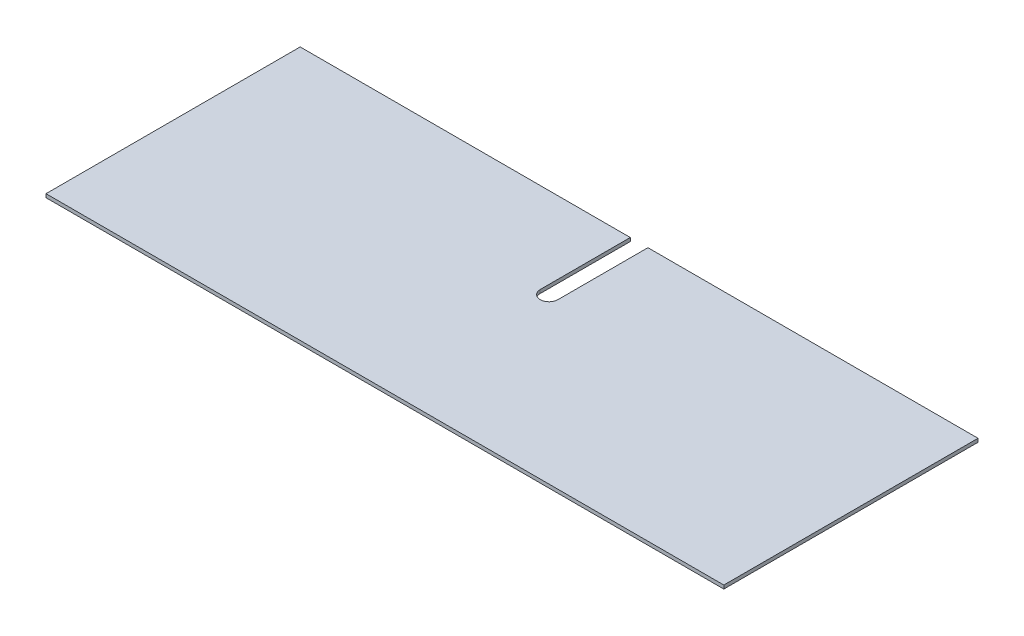
ISO-10303-21;
HEADER;
FILE_DESCRIPTION(('STEP AP214'),'2;1');
FILE_NAME('part.step','',(''),(''),'','','');
FILE_SCHEMA(('AUTOMOTIVE_DESIGN { 1 0 10303 214 1 1 1 1 }'));
ENDSEC;
DATA;
#1=APPLICATION_CONTEXT('core data for automotive mechanical design processes');
#2=APPLICATION_PROTOCOL_DEFINITION('international standard','automotive_design',2000,#1);
#3=PRODUCT_CONTEXT('',#1,'mechanical');
#4=PRODUCT('Part','Part','',(#3));
#5=PRODUCT_RELATED_PRODUCT_CATEGORY('part','',(#4));
#6=PRODUCT_DEFINITION_FORMATION('','',#4);
#7=PRODUCT_DEFINITION_CONTEXT('part definition',#1,'design');
#8=PRODUCT_DEFINITION('design','',#6,#7);
#9=PRODUCT_DEFINITION_SHAPE('','',#8);
#10=(LENGTH_UNIT() NAMED_UNIT(*) SI_UNIT(.MILLI.,.METRE.));
#11=(NAMED_UNIT(*) PLANE_ANGLE_UNIT() SI_UNIT($,.RADIAN.));
#12=(NAMED_UNIT(*) SI_UNIT($,.STERADIAN.) SOLID_ANGLE_UNIT());
#13=UNCERTAINTY_MEASURE_WITH_UNIT(LENGTH_MEASURE(1.E-05),#10,'distance_accuracy_value','');
#14=(GEOMETRIC_REPRESENTATION_CONTEXT(3) GLOBAL_UNCERTAINTY_ASSIGNED_CONTEXT((#13)) GLOBAL_UNIT_ASSIGNED_CONTEXT((#10,
#11,#12)) REPRESENTATION_CONTEXT('',''));
#15=CARTESIAN_POINT('',(0.,0.,0.));
#16=DIRECTION('',(0.,0.,1.));
#17=DIRECTION('',(1.,0.,0.));
#18=AXIS2_PLACEMENT_3D('',#15,#16,#17);
#19=CARTESIAN_POINT('',(0.,3.175,-228.6));
#20=DIRECTION('',(0.,0.,1.));
#21=DIRECTION('',(1.,0.,0.));
#22=AXIS2_PLACEMENT_3D('',#19,#20,#21);
#23=PLANE('',#22);
#24=DIRECTION('',(-1.,0.,0.));
#25=VECTOR('',#24,1.);
#26=CARTESIAN_POINT('',(0.,3.175,-228.6));
#27=LINE('',#26,#25);
#28=CARTESIAN_POINT('',(296.8625,3.175,-228.6));
#29=VERTEX_POINT('',#28);
#30=CARTESIAN_POINT('',(0.,3.175,-228.6));
#31=VERTEX_POINT('',#30);
#32=EDGE_CURVE('E70',#29,#31,#27,.T.);
#33=ORIENTED_EDGE('',*,*,#32,.F.);
#34=DIRECTION('',(0.,1.,0.));
#35=VECTOR('',#34,1.);
#36=CARTESIAN_POINT('',(296.8625,0.,-228.6));
#37=LINE('',#36,#35);
#38=CARTESIAN_POINT('',(296.8625,0.,-228.6));
#39=VERTEX_POINT('',#38);
#40=EDGE_CURVE('E162',#39,#29,#37,.T.);
#41=ORIENTED_EDGE('',*,*,#40,.F.);
#42=DIRECTION('',(-1.,0.,0.));
#43=VECTOR('',#42,1.);
#44=CARTESIAN_POINT('',(0.,0.,-228.6));
#45=LINE('',#44,#43);
#46=CARTESIAN_POINT('',(0.,0.,-228.6));
#47=VERTEX_POINT('',#46);
#48=EDGE_CURVE('E95',#39,#47,#45,.T.);
#49=ORIENTED_EDGE('',*,*,#48,.T.);
#50=DIRECTION('',(0.,-1.,0.));
#51=VECTOR('',#50,1.);
#52=CARTESIAN_POINT('',(0.,3.175,-228.6));
#53=LINE('',#52,#51);
#54=EDGE_CURVE('E185',#31,#47,#53,.T.);
#55=ORIENTED_EDGE('',*,*,#54,.F.);
#56=EDGE_LOOP('',(#33,#41,#49,#55));
#57=FACE_BOUND('',#56,.T.);
#58=ADVANCED_FACE('F40',(#57),#23,.F.);
#59=CARTESIAN_POINT('',(0.,3.175,0.));
#60=DIRECTION('',(1.,0.,0.));
#61=DIRECTION('',(0.,0.,-1.));
#62=AXIS2_PLACEMENT_3D('',#59,#60,#61);
#63=PLANE('',#62);
#64=DIRECTION('',(0.,0.,1.));
#65=VECTOR('',#64,1.);
#66=CARTESIAN_POINT('',(0.,0.,0.));
#67=LINE('',#66,#65);
#68=CARTESIAN_POINT('',(0.,0.,0.));
#69=VERTEX_POINT('',#68);
#70=EDGE_CURVE('E165',#47,#69,#67,.T.);
#71=ORIENTED_EDGE('',*,*,#70,.T.);
#72=DIRECTION('',(0.,-1.,0.));
#73=VECTOR('',#72,1.);
#74=CARTESIAN_POINT('',(0.,3.175,0.));
#75=LINE('',#74,#73);
#76=CARTESIAN_POINT('',(0.,3.175,0.));
#77=VERTEX_POINT('',#76);
#78=EDGE_CURVE('E11',#77,#69,#75,.T.);
#79=ORIENTED_EDGE('',*,*,#78,.F.);
#80=DIRECTION('',(0.,0.,1.));
#81=VECTOR('',#80,1.);
#82=CARTESIAN_POINT('',(0.,3.175,0.));
#83=LINE('',#82,#81);
#84=EDGE_CURVE('E172',#31,#77,#83,.T.);
#85=ORIENTED_EDGE('',*,*,#84,.F.);
#86=ORIENTED_EDGE('',*,*,#54,.T.);
#87=EDGE_LOOP('',(#71,#79,#85,#86));
#88=FACE_BOUND('',#87,.T.);
#89=ADVANCED_FACE('F42',(#88),#63,.F.);
#90=CARTESIAN_POINT('',(0.,3.175,0.));
#91=DIRECTION('',(0.,0.,-1.));
#92=DIRECTION('',(-1.,0.,0.));
#93=AXIS2_PLACEMENT_3D('',#90,#91,#92);
#94=PLANE('',#93);
#95=DIRECTION('',(1.,0.,0.));
#96=VECTOR('',#95,1.);
#97=CARTESIAN_POINT('',(0.,0.,0.));
#98=LINE('',#97,#96);
#99=CARTESIAN_POINT('',(609.6,0.,0.));
#100=VERTEX_POINT('',#99);
#101=EDGE_CURVE('E189',#69,#100,#98,.T.);
#102=ORIENTED_EDGE('',*,*,#101,.T.);
#103=DIRECTION('',(0.,-1.,0.));
#104=VECTOR('',#103,1.);
#105=CARTESIAN_POINT('',(609.6,3.175,0.));
#106=LINE('',#105,#104);
#107=CARTESIAN_POINT('',(609.6,3.175,0.));
#108=VERTEX_POINT('',#107);
#109=EDGE_CURVE('E49',#108,#100,#106,.T.);
#110=ORIENTED_EDGE('',*,*,#109,.F.);
#111=DIRECTION('',(1.,0.,0.));
#112=VECTOR('',#111,1.);
#113=CARTESIAN_POINT('',(0.,3.175,0.));
#114=LINE('',#113,#112);
#115=EDGE_CURVE('E102',#77,#108,#114,.T.);
#116=ORIENTED_EDGE('',*,*,#115,.F.);
#117=ORIENTED_EDGE('',*,*,#78,.T.);
#118=EDGE_LOOP('',(#102,#110,#116,#117));
#119=FACE_BOUND('',#118,.T.);
#120=ADVANCED_FACE('F218',(#119),#94,.F.);
#121=CARTESIAN_POINT('',(609.6,3.175,0.));
#122=DIRECTION('',(-1.,0.,0.));
#123=DIRECTION('',(0.,0.,1.));
#124=AXIS2_PLACEMENT_3D('',#121,#122,#123);
#125=PLANE('',#124);
#126=DIRECTION('',(0.,0.,-1.));
#127=VECTOR('',#126,1.);
#128=CARTESIAN_POINT('',(609.6,0.,0.));
#129=LINE('',#128,#127);
#130=CARTESIAN_POINT('',(609.6,0.,-228.6));
#131=VERTEX_POINT('',#130);
#132=EDGE_CURVE('E192',#100,#131,#129,.T.);
#133=ORIENTED_EDGE('',*,*,#132,.T.);
#134=DIRECTION('',(0.,-1.,0.));
#135=VECTOR('',#134,1.);
#136=CARTESIAN_POINT('',(609.6,3.175,-228.6));
#137=LINE('',#136,#135);
#138=CARTESIAN_POINT('',(609.6,3.175,-228.6));
#139=VERTEX_POINT('',#138);
#140=EDGE_CURVE('E200',#139,#131,#137,.T.);
#141=ORIENTED_EDGE('',*,*,#140,.F.);
#142=DIRECTION('',(0.,0.,-1.));
#143=VECTOR('',#142,1.);
#144=CARTESIAN_POINT('',(609.6,3.175,0.));
#145=LINE('',#144,#143);
#146=EDGE_CURVE('E178',#108,#139,#145,.T.);
#147=ORIENTED_EDGE('',*,*,#146,.F.);
#148=ORIENTED_EDGE('',*,*,#109,.T.);
#149=EDGE_LOOP('',(#133,#141,#147,#148));
#150=FACE_BOUND('',#149,.T.);
#151=ADVANCED_FACE('F207',(#150),#125,.F.);
#152=CARTESIAN_POINT('',(312.7375,0.,-228.6));
#153=VERTEX_POINT('',#152);
#154=EDGE_CURVE('E175',#131,#153,#45,.T.);
#155=ORIENTED_EDGE('',*,*,#154,.T.);
#156=DIRECTION('',(0.,1.,0.));
#157=VECTOR('',#156,1.);
#158=CARTESIAN_POINT('',(312.7375,0.,-228.6));
#159=LINE('',#158,#157);
#160=CARTESIAN_POINT('',(312.7375,3.175,-228.6));
#161=VERTEX_POINT('',#160);
#162=EDGE_CURVE('E166',#153,#161,#159,.T.);
#163=ORIENTED_EDGE('',*,*,#162,.T.);
#164=EDGE_CURVE('E181',#139,#161,#27,.T.);
#165=ORIENTED_EDGE('',*,*,#164,.F.);
#166=ORIENTED_EDGE('',*,*,#140,.T.);
#167=EDGE_LOOP('',(#155,#163,#165,#166));
#168=FACE_BOUND('',#167,.T.);
#169=ADVANCED_FACE('F211',(#168),#23,.F.);
#170=CARTESIAN_POINT('',(0.,3.175,0.));
#171=DIRECTION('',(0.,-1.,0.));
#172=DIRECTION('',(0.,0.,-1.));
#173=AXIS2_PLACEMENT_3D('',#170,#171,#172);
#174=PLANE('',#173);
#175=CARTESIAN_POINT('',(304.8,3.175,-147.6375));
#176=DIRECTION('',(0.,1.,0.));
#177=DIRECTION('',(0.,0.,1.));
#178=AXIS2_PLACEMENT_3D('',#175,#176,#177);
#179=CIRCLE('',#178,7.93750000000004);
#180=CARTESIAN_POINT('',(296.8625,3.175,-147.6375));
#181=VERTEX_POINT('',#180);
#182=CARTESIAN_POINT('',(312.7375,3.175,-147.6375));
#183=VERTEX_POINT('',#182);
#184=EDGE_CURVE('E155',#181,#183,#179,.T.);
#185=ORIENTED_EDGE('',*,*,#184,.F.);
#186=DIRECTION('',(0.,0.,1.));
#187=VECTOR('',#186,1.);
#188=CARTESIAN_POINT('',(296.8625,3.175,-228.6));
#189=LINE('',#188,#187);
#190=EDGE_CURVE('E134',#29,#181,#189,.T.);
#191=ORIENTED_EDGE('',*,*,#190,.F.);
#192=ORIENTED_EDGE('',*,*,#32,.T.);
#193=ORIENTED_EDGE('',*,*,#84,.T.);
#194=ORIENTED_EDGE('',*,*,#115,.T.);
#195=ORIENTED_EDGE('',*,*,#146,.T.);
#196=ORIENTED_EDGE('',*,*,#164,.T.);
#197=DIRECTION('',(0.,0.,-1.));
#198=VECTOR('',#197,1.);
#199=CARTESIAN_POINT('',(312.7375,3.175,-228.6));
#200=LINE('',#199,#198);
#201=EDGE_CURVE('E150',#183,#161,#200,.T.);
#202=ORIENTED_EDGE('',*,*,#201,.F.);
#203=EDGE_LOOP('',(#185,#191,#192,#193,#194,#195,#196,#202));
#204=FACE_BOUND('',#203,.T.);
#205=ADVANCED_FACE('F214',(#204),#174,.F.);
#206=CARTESIAN_POINT('',(0.,0.,0.));
#207=DIRECTION('',(0.,-1.,0.));
#208=DIRECTION('',(0.,0.,-1.));
#209=AXIS2_PLACEMENT_3D('',#206,#207,#208);
#210=PLANE('',#209);
#211=DIRECTION('',(0.,0.,1.));
#212=VECTOR('',#211,1.);
#213=CARTESIAN_POINT('',(296.8625,0.,-228.6));
#214=LINE('',#213,#212);
#215=CARTESIAN_POINT('',(296.8625,0.,-147.6375));
#216=VERTEX_POINT('',#215);
#217=EDGE_CURVE('E133',#39,#216,#214,.T.);
#218=ORIENTED_EDGE('',*,*,#217,.T.);
#219=CARTESIAN_POINT('',(304.8,0.,-147.6375));
#220=DIRECTION('',(0.,1.,0.));
#221=DIRECTION('',(0.,0.,1.));
#222=AXIS2_PLACEMENT_3D('',#219,#220,#221);
#223=CIRCLE('',#222,7.93750000000004);
#224=CARTESIAN_POINT('',(312.7375,0.,-147.6375));
#225=VERTEX_POINT('',#224);
#226=EDGE_CURVE('E142',#216,#225,#223,.T.);
#227=ORIENTED_EDGE('',*,*,#226,.T.);
#228=DIRECTION('',(0.,0.,-1.));
#229=VECTOR('',#228,1.);
#230=CARTESIAN_POINT('',(312.7375,0.,-228.6));
#231=LINE('',#230,#229);
#232=EDGE_CURVE('E59',#225,#153,#231,.T.);
#233=ORIENTED_EDGE('',*,*,#232,.T.);
#234=ORIENTED_EDGE('',*,*,#154,.F.);
#235=ORIENTED_EDGE('',*,*,#132,.F.);
#236=ORIENTED_EDGE('',*,*,#101,.F.);
#237=ORIENTED_EDGE('',*,*,#70,.F.);
#238=ORIENTED_EDGE('',*,*,#48,.F.);
#239=EDGE_LOOP('',(#218,#227,#233,#234,#235,#236,#237,#238));
#240=FACE_BOUND('',#239,.T.);
#241=ADVANCED_FACE('F147',(#240),#210,.T.);
#242=CARTESIAN_POINT('',(296.8625,0.,-228.6));
#243=DIRECTION('',(-1.,0.,0.));
#244=DIRECTION('',(0.,0.,1.));
#245=AXIS2_PLACEMENT_3D('',#242,#243,#244);
#246=PLANE('',#245);
#247=ORIENTED_EDGE('',*,*,#190,.T.);
#248=DIRECTION('',(0.,1.,0.));
#249=VECTOR('',#248,1.);
#250=CARTESIAN_POINT('',(296.8625,0.,-147.6375));
#251=LINE('',#250,#249);
#252=EDGE_CURVE('E129',#216,#181,#251,.T.);
#253=ORIENTED_EDGE('',*,*,#252,.F.);
#254=ORIENTED_EDGE('',*,*,#217,.F.);
#255=ORIENTED_EDGE('',*,*,#40,.T.);
#256=EDGE_LOOP('',(#247,#253,#254,#255));
#257=FACE_BOUND('',#256,.T.);
#258=ADVANCED_FACE('F131',(#257),#246,.F.);
#259=CARTESIAN_POINT('',(312.7375,0.,-228.6));
#260=DIRECTION('',(1.,0.,0.));
#261=DIRECTION('',(0.,0.,-1.));
#262=AXIS2_PLACEMENT_3D('',#259,#260,#261);
#263=PLANE('',#262);
#264=ORIENTED_EDGE('',*,*,#201,.T.);
#265=ORIENTED_EDGE('',*,*,#162,.F.);
#266=ORIENTED_EDGE('',*,*,#232,.F.);
#267=DIRECTION('',(0.,1.,0.));
#268=VECTOR('',#267,1.);
#269=CARTESIAN_POINT('',(312.7375,0.,-147.6375));
#270=LINE('',#269,#268);
#271=EDGE_CURVE('E139',#225,#183,#270,.T.);
#272=ORIENTED_EDGE('',*,*,#271,.T.);
#273=EDGE_LOOP('',(#264,#265,#266,#272));
#274=FACE_BOUND('',#273,.T.);
#275=ADVANCED_FACE('F241',(#274),#263,.F.);
#276=CARTESIAN_POINT('',(304.8,0.,-147.6375));
#277=DIRECTION('',(0.,1.,0.));
#278=DIRECTION('',(0.,0.,1.));
#279=AXIS2_PLACEMENT_3D('',#276,#277,#278);
#280=CYLINDRICAL_SURFACE('',#279,7.93750000000004);
#281=ORIENTED_EDGE('',*,*,#184,.T.);
#282=ORIENTED_EDGE('',*,*,#271,.F.);
#283=ORIENTED_EDGE('',*,*,#226,.F.);
#284=ORIENTED_EDGE('',*,*,#252,.T.);
#285=EDGE_LOOP('',(#281,#282,#283,#284));
#286=FACE_BOUND('',#285,.T.);
#287=ADVANCED_FACE('F143',(#286),#280,.F.);
#288=CLOSED_SHELL('',(#58,#89,#120,#151,#169,#205,#241,#258,#275,#287));
#289=MANIFOLD_SOLID_BREP('B2',#288);
#290=ADVANCED_BREP_SHAPE_REPRESENTATION('',(#18,#289),#14);
#291=SHAPE_DEFINITION_REPRESENTATION(#9,#290);
ENDSEC;
END-ISO-10303-21;
